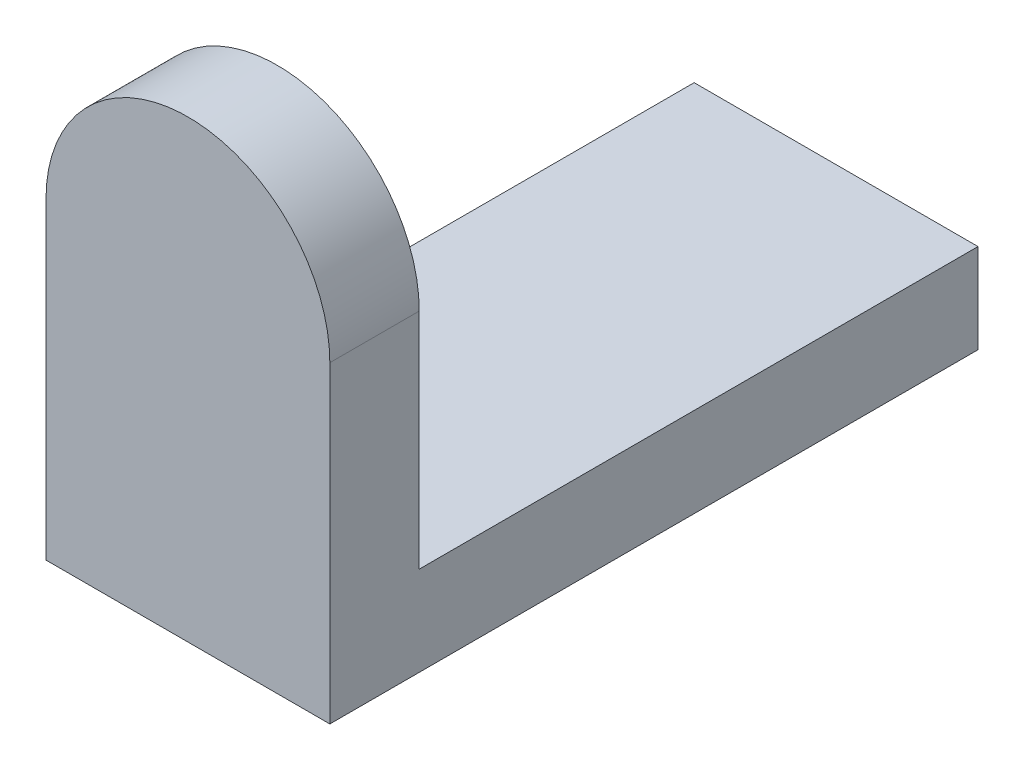
ISO-10303-21;
HEADER;
FILE_DESCRIPTION(('STEP AP214'),'2;1');
FILE_NAME('part.step','',(''),(''),'','','');
FILE_SCHEMA(('AUTOMOTIVE_DESIGN { 1 0 10303 214 1 1 1 1 }'));
ENDSEC;
DATA;
#1=APPLICATION_CONTEXT('core data for automotive mechanical design processes');
#2=APPLICATION_PROTOCOL_DEFINITION('international standard','automotive_design',2000,#1);
#3=PRODUCT_CONTEXT('',#1,'mechanical');
#4=PRODUCT('Part','Part','',(#3));
#5=PRODUCT_RELATED_PRODUCT_CATEGORY('part','',(#4));
#6=PRODUCT_DEFINITION_FORMATION('','',#4);
#7=PRODUCT_DEFINITION_CONTEXT('part definition',#1,'design');
#8=PRODUCT_DEFINITION('design','',#6,#7);
#9=PRODUCT_DEFINITION_SHAPE('','',#8);
#10=(LENGTH_UNIT() NAMED_UNIT(*) SI_UNIT(.MILLI.,.METRE.));
#11=(NAMED_UNIT(*) PLANE_ANGLE_UNIT() SI_UNIT($,.RADIAN.));
#12=(NAMED_UNIT(*) SI_UNIT($,.STERADIAN.) SOLID_ANGLE_UNIT());
#13=UNCERTAINTY_MEASURE_WITH_UNIT(LENGTH_MEASURE(1.E-05),#10,'distance_accuracy_value','');
#14=(GEOMETRIC_REPRESENTATION_CONTEXT(3) GLOBAL_UNCERTAINTY_ASSIGNED_CONTEXT((#13)) GLOBAL_UNIT_ASSIGNED_CONTEXT((#10,
#11,#12)) REPRESENTATION_CONTEXT('',''));
#15=CARTESIAN_POINT('',(0.,0.,0.));
#16=DIRECTION('',(0.,0.,1.));
#17=DIRECTION('',(1.,0.,0.));
#18=AXIS2_PLACEMENT_3D('',#15,#16,#17);
#19=CARTESIAN_POINT('',(12.7,8.,25.));
#20=DIRECTION('',(-1.,0.,0.));
#21=DIRECTION('',(0.,0.,1.));
#22=AXIS2_PLACEMENT_3D('',#19,#20,#21);
#23=PLANE('',#22);
#24=DIRECTION('',(0.,0.,-1.));
#25=VECTOR('',#24,1.);
#26=CARTESIAN_POINT('',(12.7,0.,25.));
#27=LINE('',#26,#25);
#28=CARTESIAN_POINT('',(12.7,0.,33.));
#29=VERTEX_POINT('',#28);
#30=CARTESIAN_POINT('',(12.7,0.,-25.));
#31=VERTEX_POINT('',#30);
#32=EDGE_CURVE('E97',#29,#31,#27,.T.);
#33=ORIENTED_EDGE('',*,*,#32,.T.);
#34=DIRECTION('',(0.,-1.,0.));
#35=VECTOR('',#34,1.);
#36=CARTESIAN_POINT('',(12.7,8.,-25.));
#37=LINE('',#36,#35);
#38=CARTESIAN_POINT('',(12.7,8.,-25.));
#39=VERTEX_POINT('',#38);
#40=EDGE_CURVE('E11',#39,#31,#37,.T.);
#41=ORIENTED_EDGE('',*,*,#40,.F.);
#42=DIRECTION('',(0.,0.,-1.));
#43=VECTOR('',#42,1.);
#44=CARTESIAN_POINT('',(12.7,8.,25.));
#45=LINE('',#44,#43);
#46=CARTESIAN_POINT('',(12.7,8.,25.));
#47=VERTEX_POINT('',#46);
#48=EDGE_CURVE('E89',#47,#39,#45,.T.);
#49=ORIENTED_EDGE('',*,*,#48,.F.);
#50=DIRECTION('',(0.,1.,0.));
#51=VECTOR('',#50,1.);
#52=CARTESIAN_POINT('',(12.7,0.,25.));
#53=LINE('',#52,#51);
#54=CARTESIAN_POINT('',(12.7,28.,25.));
#55=VERTEX_POINT('',#54);
#56=EDGE_CURVE('E51',#47,#55,#53,.T.);
#57=ORIENTED_EDGE('',*,*,#56,.T.);
#58=DIRECTION('',(0.,0.,-1.));
#59=VECTOR('',#58,1.);
#60=CARTESIAN_POINT('',(12.7,28.,33.));
#61=LINE('',#60,#59);
#62=CARTESIAN_POINT('',(12.7,28.,33.));
#63=VERTEX_POINT('',#62);
#64=EDGE_CURVE('E104',#63,#55,#61,.T.);
#65=ORIENTED_EDGE('',*,*,#64,.F.);
#66=DIRECTION('',(0.,1.,0.));
#67=VECTOR('',#66,1.);
#68=CARTESIAN_POINT('',(12.7,0.,33.));
#69=LINE('',#68,#67);
#70=EDGE_CURVE('E101',#29,#63,#69,.T.);
#71=ORIENTED_EDGE('',*,*,#70,.F.);
#72=EDGE_LOOP('',(#33,#41,#49,#57,#65,#71));
#73=FACE_BOUND('',#72,.T.);
#74=ADVANCED_FACE('F35',(#73),#23,.F.);
#75=CARTESIAN_POINT('',(-12.7,8.,-25.));
#76=DIRECTION('',(0.,0.,1.));
#77=DIRECTION('',(1.,0.,0.));
#78=AXIS2_PLACEMENT_3D('',#75,#76,#77);
#79=PLANE('',#78);
#80=DIRECTION('',(-1.,0.,0.));
#81=VECTOR('',#80,1.);
#82=CARTESIAN_POINT('',(-12.7,0.,-25.));
#83=LINE('',#82,#81);
#84=CARTESIAN_POINT('',(-12.7,0.,-25.));
#85=VERTEX_POINT('',#84);
#86=EDGE_CURVE('E64',#31,#85,#83,.T.);
#87=ORIENTED_EDGE('',*,*,#86,.T.);
#88=DIRECTION('',(0.,-1.,0.));
#89=VECTOR('',#88,1.);
#90=CARTESIAN_POINT('',(-12.7,8.,-25.));
#91=LINE('',#90,#89);
#92=CARTESIAN_POINT('',(-12.7,8.,-25.));
#93=VERTEX_POINT('',#92);
#94=EDGE_CURVE('E43',#93,#85,#91,.T.);
#95=ORIENTED_EDGE('',*,*,#94,.F.);
#96=DIRECTION('',(-1.,0.,0.));
#97=VECTOR('',#96,1.);
#98=CARTESIAN_POINT('',(-12.7,8.,-25.));
#99=LINE('',#98,#97);
#100=EDGE_CURVE('E79',#39,#93,#99,.T.);
#101=ORIENTED_EDGE('',*,*,#100,.F.);
#102=ORIENTED_EDGE('',*,*,#40,.T.);
#103=EDGE_LOOP('',(#87,#95,#101,#102));
#104=FACE_BOUND('',#103,.T.);
#105=ADVANCED_FACE('F81',(#104),#79,.F.);
#106=CARTESIAN_POINT('',(-12.7,8.,25.));
#107=DIRECTION('',(1.,0.,0.));
#108=DIRECTION('',(0.,0.,-1.));
#109=AXIS2_PLACEMENT_3D('',#106,#107,#108);
#110=PLANE('',#109);
#111=DIRECTION('',(0.,0.,1.));
#112=VECTOR('',#111,1.);
#113=CARTESIAN_POINT('',(-12.7,0.,25.));
#114=LINE('',#113,#112);
#115=CARTESIAN_POINT('',(-12.7,0.,33.));
#116=VERTEX_POINT('',#115);
#117=EDGE_CURVE('E94',#85,#116,#114,.T.);
#118=ORIENTED_EDGE('',*,*,#117,.T.);
#119=DIRECTION('',(0.,-1.,0.));
#120=VECTOR('',#119,1.);
#121=CARTESIAN_POINT('',(-12.7,0.,33.));
#122=LINE('',#121,#120);
#123=CARTESIAN_POINT('',(-12.7,28.,33.));
#124=VERTEX_POINT('',#123);
#125=EDGE_CURVE('E122',#124,#116,#122,.T.);
#126=ORIENTED_EDGE('',*,*,#125,.F.);
#127=DIRECTION('',(0.,0.,-1.));
#128=VECTOR('',#127,1.);
#129=CARTESIAN_POINT('',(-12.7,28.,33.));
#130=LINE('',#129,#128);
#131=CARTESIAN_POINT('',(-12.7,28.,25.));
#132=VERTEX_POINT('',#131);
#133=EDGE_CURVE('E108',#124,#132,#130,.T.);
#134=ORIENTED_EDGE('',*,*,#133,.T.);
#135=DIRECTION('',(0.,-1.,0.));
#136=VECTOR('',#135,1.);
#137=CARTESIAN_POINT('',(-12.7,0.,25.));
#138=LINE('',#137,#136);
#139=CARTESIAN_POINT('',(-12.7,8.,25.));
#140=VERTEX_POINT('',#139);
#141=EDGE_CURVE('E124',#132,#140,#138,.T.);
#142=ORIENTED_EDGE('',*,*,#141,.T.);
#143=DIRECTION('',(0.,0.,1.));
#144=VECTOR('',#143,1.);
#145=CARTESIAN_POINT('',(-12.7,8.,25.));
#146=LINE('',#145,#144);
#147=EDGE_CURVE('E88',#93,#140,#146,.T.);
#148=ORIENTED_EDGE('',*,*,#147,.F.);
#149=ORIENTED_EDGE('',*,*,#94,.T.);
#150=EDGE_LOOP('',(#118,#126,#134,#142,#148,#149));
#151=FACE_BOUND('',#150,.T.);
#152=ADVANCED_FACE('F138',(#151),#110,.F.);
#153=CARTESIAN_POINT('',(0.,8.,0.));
#154=DIRECTION('',(0.,-1.,0.));
#155=DIRECTION('',(0.,0.,-1.));
#156=AXIS2_PLACEMENT_3D('',#153,#154,#155);
#157=PLANE('',#156);
#158=ORIENTED_EDGE('',*,*,#48,.T.);
#159=ORIENTED_EDGE('',*,*,#100,.T.);
#160=ORIENTED_EDGE('',*,*,#147,.T.);
#161=DIRECTION('',(1.,0.,0.));
#162=VECTOR('',#161,1.);
#163=CARTESIAN_POINT('',(-12.7,8.,25.));
#164=LINE('',#163,#162);
#165=EDGE_CURVE('E68',#140,#47,#164,.T.);
#166=ORIENTED_EDGE('',*,*,#165,.T.);
#167=EDGE_LOOP('',(#158,#159,#160,#166));
#168=FACE_BOUND('',#167,.T.);
#169=ADVANCED_FACE('F92',(#168),#157,.F.);
#170=CARTESIAN_POINT('',(0.,0.,0.));
#171=DIRECTION('',(0.,-1.,0.));
#172=DIRECTION('',(0.,0.,-1.));
#173=AXIS2_PLACEMENT_3D('',#170,#171,#172);
#174=PLANE('',#173);
#175=ORIENTED_EDGE('',*,*,#32,.F.);
#176=DIRECTION('',(1.,0.,0.));
#177=VECTOR('',#176,1.);
#178=CARTESIAN_POINT('',(-12.7,0.,33.));
#179=LINE('',#178,#177);
#180=EDGE_CURVE('E128',#116,#29,#179,.T.);
#181=ORIENTED_EDGE('',*,*,#180,.F.);
#182=ORIENTED_EDGE('',*,*,#117,.F.);
#183=ORIENTED_EDGE('',*,*,#86,.F.);
#184=EDGE_LOOP('',(#175,#181,#182,#183));
#185=FACE_BOUND('',#184,.T.);
#186=ADVANCED_FACE('F139',(#185),#174,.T.);
#187=CARTESIAN_POINT('',(0.,28.,33.));
#188=DIRECTION('',(0.,0.,-1.));
#189=DIRECTION('',(-1.,0.,0.));
#190=AXIS2_PLACEMENT_3D('',#187,#188,#189);
#191=CYLINDRICAL_SURFACE('',#190,12.7);
#192=CARTESIAN_POINT('',(0.,28.,25.));
#193=DIRECTION('',(0.,0.,1.));
#194=DIRECTION('',(1.,0.,0.));
#195=AXIS2_PLACEMENT_3D('',#192,#193,#194);
#196=CIRCLE('',#195,12.7);
#197=EDGE_CURVE('E119',#55,#132,#196,.T.);
#198=ORIENTED_EDGE('',*,*,#197,.T.);
#199=ORIENTED_EDGE('',*,*,#133,.F.);
#200=CARTESIAN_POINT('',(0.,28.,33.));
#201=DIRECTION('',(0.,0.,1.));
#202=DIRECTION('',(1.,0.,0.));
#203=AXIS2_PLACEMENT_3D('',#200,#201,#202);
#204=CIRCLE('',#203,12.7);
#205=EDGE_CURVE('E118',#63,#124,#204,.T.);
#206=ORIENTED_EDGE('',*,*,#205,.F.);
#207=ORIENTED_EDGE('',*,*,#64,.T.);
#208=EDGE_LOOP('',(#198,#199,#206,#207));
#209=FACE_BOUND('',#208,.T.);
#210=ADVANCED_FACE('F141',(#209),#191,.T.);
#211=CARTESIAN_POINT('',(0.,28.,33.));
#212=DIRECTION('',(0.,0.,1.));
#213=DIRECTION('',(1.,0.,0.));
#214=AXIS2_PLACEMENT_3D('',#211,#212,#213);
#215=PLANE('',#214);
#216=ORIENTED_EDGE('',*,*,#125,.T.);
#217=ORIENTED_EDGE('',*,*,#180,.T.);
#218=ORIENTED_EDGE('',*,*,#70,.T.);
#219=ORIENTED_EDGE('',*,*,#205,.T.);
#220=EDGE_LOOP('',(#216,#217,#218,#219));
#221=FACE_BOUND('',#220,.T.);
#222=ADVANCED_FACE('F134',(#221),#215,.T.);
#223=CARTESIAN_POINT('',(0.,28.,25.));
#224=DIRECTION('',(0.,0.,1.));
#225=DIRECTION('',(1.,0.,0.));
#226=AXIS2_PLACEMENT_3D('',#223,#224,#225);
#227=PLANE('',#226);
#228=ORIENTED_EDGE('',*,*,#165,.F.);
#229=ORIENTED_EDGE('',*,*,#141,.F.);
#230=ORIENTED_EDGE('',*,*,#197,.F.);
#231=ORIENTED_EDGE('',*,*,#56,.F.);
#232=EDGE_LOOP('',(#228,#229,#230,#231));
#233=FACE_BOUND('',#232,.T.);
#234=ADVANCED_FACE('F185',(#233),#227,.F.);
#235=CLOSED_SHELL('',(#74,#105,#152,#169,#186,#210,#222,#234));
#236=MANIFOLD_SOLID_BREP('B2',#235);
#237=ADVANCED_BREP_SHAPE_REPRESENTATION('',(#18,#236),#14);
#238=SHAPE_DEFINITION_REPRESENTATION(#9,#237);
ENDSEC;
END-ISO-10303-21;
